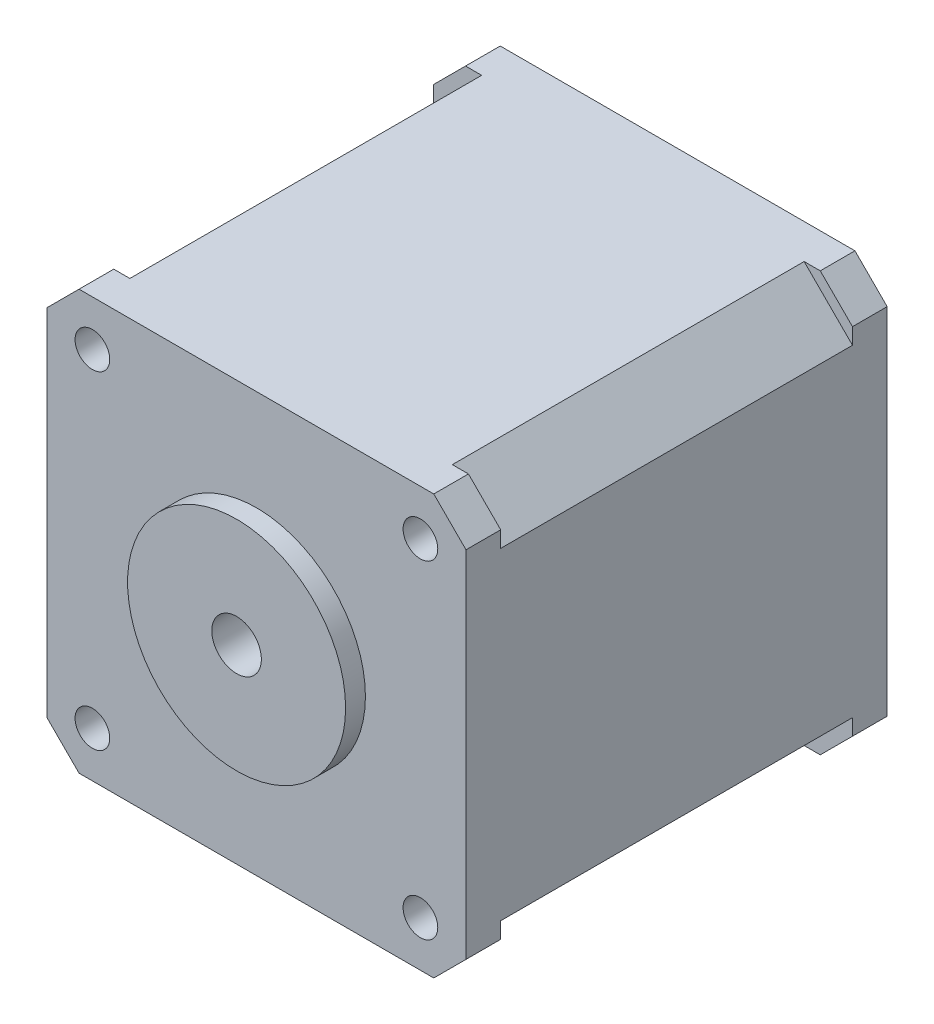
ISO-10303-21;
HEADER;
FILE_DESCRIPTION(('STEP AP214'),'2;1');
FILE_NAME('part.step','',(''),(''),'','','');
FILE_SCHEMA(('AUTOMOTIVE_DESIGN { 1 0 10303 214 1 1 1 1 }'));
ENDSEC;
DATA;
#1=APPLICATION_CONTEXT('core data for automotive mechanical design processes');
#2=APPLICATION_PROTOCOL_DEFINITION('international standard','automotive_design',2000,#1);
#3=PRODUCT_CONTEXT('',#1,'mechanical');
#4=PRODUCT('Part','Part','',(#3));
#5=PRODUCT_RELATED_PRODUCT_CATEGORY('part','',(#4));
#6=PRODUCT_DEFINITION_FORMATION('','',#4);
#7=PRODUCT_DEFINITION_CONTEXT('part definition',#1,'design');
#8=PRODUCT_DEFINITION('design','',#6,#7);
#9=PRODUCT_DEFINITION_SHAPE('','',#8);
#10=(LENGTH_UNIT() NAMED_UNIT(*) SI_UNIT(.MILLI.,.METRE.));
#11=(NAMED_UNIT(*) PLANE_ANGLE_UNIT() SI_UNIT($,.RADIAN.));
#12=(NAMED_UNIT(*) SI_UNIT($,.STERADIAN.) SOLID_ANGLE_UNIT());
#13=UNCERTAINTY_MEASURE_WITH_UNIT(LENGTH_MEASURE(1.E-05),#10,'distance_accuracy_value','');
#14=(GEOMETRIC_REPRESENTATION_CONTEXT(3) GLOBAL_UNCERTAINTY_ASSIGNED_CONTEXT((#13)) GLOBAL_UNIT_ASSIGNED_CONTEXT((#10,
#11,#12)) REPRESENTATION_CONTEXT('',''));
#15=CARTESIAN_POINT('',(0.,0.,0.));
#16=DIRECTION('',(0.,0.,1.));
#17=DIRECTION('',(1.,0.,0.));
#18=AXIS2_PLACEMENT_3D('',#15,#16,#17);
#19=CARTESIAN_POINT('',(-21.15,-21.15,42.5));
#20=DIRECTION('',(1.,0.,0.));
#21=DIRECTION('',(0.,0.,-1.));
#22=AXIS2_PLACEMENT_3D('',#19,#20,#21);
#23=PLANE('',#22);
#24=DIRECTION('',(0.,1.,0.));
#25=VECTOR('',#24,1.);
#26=CARTESIAN_POINT('',(-21.15,-21.15,39.));
#27=LINE('',#26,#25);
#28=CARTESIAN_POINT('',(-21.1500000000011,-17.8973088065396,39.));
#29=VERTEX_POINT('',#28);
#30=CARTESIAN_POINT('',(-21.15,-16.2709632098128,39.));
#31=VERTEX_POINT('',#30);
#32=EDGE_CURVE('E223',#29,#31,#27,.T.);
#33=ORIENTED_EDGE('',*,*,#32,.F.);
#34=DIRECTION('',(0.,0.,1.));
#35=VECTOR('',#34,1.);
#36=CARTESIAN_POINT('',(-21.1500000000011,-17.8973088065396,0.));
#37=LINE('',#36,#35);
#38=CARTESIAN_POINT('',(-21.1500000000011,-17.8973088065396,42.5));
#39=VERTEX_POINT('',#38);
#40=EDGE_CURVE('E312',#29,#39,#37,.T.);
#41=ORIENTED_EDGE('',*,*,#40,.T.);
#42=DIRECTION('',(0.,-1.,0.));
#43=VECTOR('',#42,1.);
#44=CARTESIAN_POINT('',(-21.15,-21.15,42.5));
#45=LINE('',#44,#43);
#46=CARTESIAN_POINT('',(-21.15,17.8973088065419,42.5));
#47=VERTEX_POINT('',#46);
#48=EDGE_CURVE('E360',#47,#39,#45,.T.);
#49=ORIENTED_EDGE('',*,*,#48,.F.);
#50=DIRECTION('',(0.,0.,1.));
#51=VECTOR('',#50,1.);
#52=CARTESIAN_POINT('',(-21.15,17.8973088065419,0.));
#53=LINE('',#52,#51);
#54=CARTESIAN_POINT('',(-21.15,17.8973088065419,39.));
#55=VERTEX_POINT('',#54);
#56=EDGE_CURVE('E318',#55,#47,#53,.T.);
#57=ORIENTED_EDGE('',*,*,#56,.F.);
#58=DIRECTION('',(0.,1.,0.));
#59=VECTOR('',#58,1.);
#60=CARTESIAN_POINT('',(-21.15,-21.15,39.));
#61=LINE('',#60,#59);
#62=CARTESIAN_POINT('',(-21.15,16.2709632098128,39.));
#63=VERTEX_POINT('',#62);
#64=EDGE_CURVE('E253',#63,#55,#61,.T.);
#65=ORIENTED_EDGE('',*,*,#64,.F.);
#66=DIRECTION('',(0.,0.,1.));
#67=VECTOR('',#66,1.);
#68=CARTESIAN_POINT('',(-21.15,16.2709632098128,42.5));
#69=LINE('',#68,#67);
#70=CARTESIAN_POINT('',(-21.15,16.2709632098128,3.5));
#71=VERTEX_POINT('',#70);
#72=EDGE_CURVE('E255',#71,#63,#69,.T.);
#73=ORIENTED_EDGE('',*,*,#72,.F.);
#74=DIRECTION('',(0.,1.,0.));
#75=VECTOR('',#74,1.);
#76=CARTESIAN_POINT('',(-21.15,-21.15,3.5));
#77=LINE('',#76,#75);
#78=CARTESIAN_POINT('',(-21.15,17.8973088065419,3.5));
#79=VERTEX_POINT('',#78);
#80=EDGE_CURVE('E248',#71,#79,#77,.T.);
#81=ORIENTED_EDGE('',*,*,#80,.T.);
#82=CARTESIAN_POINT('',(-21.15,17.8973088065419,0.));
#83=VERTEX_POINT('',#82);
#84=EDGE_CURVE('E326',#83,#79,#53,.T.);
#85=ORIENTED_EDGE('',*,*,#84,.F.);
#86=DIRECTION('',(0.,-1.,0.));
#87=VECTOR('',#86,1.);
#88=CARTESIAN_POINT('',(-21.15,-21.15,0.));
#89=LINE('',#88,#87);
#90=CARTESIAN_POINT('',(-21.15,-17.8973088065407,0.));
#91=VERTEX_POINT('',#90);
#92=EDGE_CURVE('E355',#83,#91,#89,.T.);
#93=ORIENTED_EDGE('',*,*,#92,.T.);
#94=CARTESIAN_POINT('',(-21.1500000000011,-17.8973088065396,3.5));
#95=VERTEX_POINT('',#94);
#96=EDGE_CURVE('E298',#91,#95,#37,.T.);
#97=ORIENTED_EDGE('',*,*,#96,.T.);
#98=DIRECTION('',(0.,1.,0.));
#99=VECTOR('',#98,1.);
#100=CARTESIAN_POINT('',(-21.15,-21.15,3.5));
#101=LINE('',#100,#99);
#102=CARTESIAN_POINT('',(-21.15,-16.2709632098128,3.5));
#103=VERTEX_POINT('',#102);
#104=EDGE_CURVE('E204',#95,#103,#101,.T.);
#105=ORIENTED_EDGE('',*,*,#104,.T.);
#106=DIRECTION('',(0.,0.,-1.));
#107=VECTOR('',#106,1.);
#108=CARTESIAN_POINT('',(-21.15,-16.2709632098128,42.5));
#109=LINE('',#108,#107);
#110=EDGE_CURVE('E212',#31,#103,#109,.T.);
#111=ORIENTED_EDGE('',*,*,#110,.F.);
#112=EDGE_LOOP('',(#33,#41,#49,#57,#65,#73,#81,#85,#93,#97,#105,#111));
#113=FACE_BOUND('',#112,.T.);
#114=ADVANCED_FACE('F32',(#113),#23,.F.);
#115=CARTESIAN_POINT('',(21.15,-21.15,42.5));
#116=DIRECTION('',(0.,1.,0.));
#117=DIRECTION('',(-1.,0.,0.));
#118=AXIS2_PLACEMENT_3D('',#115,#116,#117);
#119=PLANE('',#118);
#120=DIRECTION('',(-1.,0.,0.));
#121=VECTOR('',#120,1.);
#122=CARTESIAN_POINT('',(21.15,-21.15,39.));
#123=LINE('',#122,#121);
#124=CARTESIAN_POINT('',(-16.2709632098128,-21.15,39.));
#125=VERTEX_POINT('',#124);
#126=CARTESIAN_POINT('',(-17.897308806543,-21.1499999999977,39.));
#127=VERTEX_POINT('',#126);
#128=EDGE_CURVE('E218',#125,#127,#123,.T.);
#129=ORIENTED_EDGE('',*,*,#128,.F.);
#130=DIRECTION('',(0.,0.,1.));
#131=VECTOR('',#130,1.);
#132=CARTESIAN_POINT('',(-16.2709632098128,-21.15,42.5));
#133=LINE('',#132,#131);
#134=CARTESIAN_POINT('',(-16.2709632098128,-21.15,3.5));
#135=VERTEX_POINT('',#134);
#136=EDGE_CURVE('E11',#135,#125,#133,.T.);
#137=ORIENTED_EDGE('',*,*,#136,.F.);
#138=DIRECTION('',(-1.,0.,0.));
#139=VECTOR('',#138,1.);
#140=CARTESIAN_POINT('',(21.15,-21.15,3.5));
#141=LINE('',#140,#139);
#142=CARTESIAN_POINT('',(-17.897308806543,-21.1499999999977,3.5));
#143=VERTEX_POINT('',#142);
#144=EDGE_CURVE('E193',#135,#143,#141,.T.);
#145=ORIENTED_EDGE('',*,*,#144,.T.);
#146=DIRECTION('',(0.,0.,1.));
#147=VECTOR('',#146,1.);
#148=CARTESIAN_POINT('',(-17.897308806543,-21.1499999999977,0.));
#149=LINE('',#148,#147);
#150=CARTESIAN_POINT('',(-17.897308806543,-21.1499999999977,0.));
#151=VERTEX_POINT('',#150);
#152=EDGE_CURVE('E313',#151,#143,#149,.T.);
#153=ORIENTED_EDGE('',*,*,#152,.F.);
#154=DIRECTION('',(1.,0.,0.));
#155=VECTOR('',#154,1.);
#156=CARTESIAN_POINT('',(21.15,-21.15,0.));
#157=LINE('',#156,#155);
#158=CARTESIAN_POINT('',(17.8973088065374,-21.15,0.));
#159=VERTEX_POINT('',#158);
#160=EDGE_CURVE('E374',#151,#159,#157,.T.);
#161=ORIENTED_EDGE('',*,*,#160,.T.);
#162=DIRECTION('',(0.,0.,1.));
#163=VECTOR('',#162,1.);
#164=CARTESIAN_POINT('',(17.8973088065385,-21.1499999999988,0.));
#165=LINE('',#164,#163);
#166=CARTESIAN_POINT('',(17.8973088065385,-21.1499999999988,3.5));
#167=VERTEX_POINT('',#166);
#168=EDGE_CURVE('E282',#159,#167,#165,.T.);
#169=ORIENTED_EDGE('',*,*,#168,.T.);
#170=DIRECTION('',(1.,0.,0.));
#171=VECTOR('',#170,1.);
#172=CARTESIAN_POINT('',(21.15,-21.15,3.5));
#173=LINE('',#172,#171);
#174=CARTESIAN_POINT('',(16.2709632098128,-21.15,3.5));
#175=VERTEX_POINT('',#174);
#176=EDGE_CURVE('E230',#175,#167,#173,.T.);
#177=ORIENTED_EDGE('',*,*,#176,.F.);
#178=DIRECTION('',(0.,0.,-1.));
#179=VECTOR('',#178,1.);
#180=CARTESIAN_POINT('',(16.2709632098128,-21.15,42.5));
#181=LINE('',#180,#179);
#182=CARTESIAN_POINT('',(16.2709632098128,-21.15,39.));
#183=VERTEX_POINT('',#182);
#184=EDGE_CURVE('E259',#183,#175,#181,.T.);
#185=ORIENTED_EDGE('',*,*,#184,.F.);
#186=DIRECTION('',(1.,0.,0.));
#187=VECTOR('',#186,1.);
#188=CARTESIAN_POINT('',(21.15,-21.15,39.));
#189=LINE('',#188,#187);
#190=CARTESIAN_POINT('',(17.8973088065385,-21.1499999999988,39.));
#191=VERTEX_POINT('',#190);
#192=EDGE_CURVE('E235',#183,#191,#189,.T.);
#193=ORIENTED_EDGE('',*,*,#192,.T.);
#194=CARTESIAN_POINT('',(17.8973088065385,-21.1499999999988,42.5));
#195=VERTEX_POINT('',#194);
#196=EDGE_CURVE('E301',#191,#195,#165,.T.);
#197=ORIENTED_EDGE('',*,*,#196,.T.);
#198=DIRECTION('',(1.,0.,0.));
#199=VECTOR('',#198,1.);
#200=CARTESIAN_POINT('',(21.15,-21.15,42.5));
#201=LINE('',#200,#199);
#202=CARTESIAN_POINT('',(-17.897308806543,-21.1499999999977,42.5));
#203=VERTEX_POINT('',#202);
#204=EDGE_CURVE('E363',#203,#195,#201,.T.);
#205=ORIENTED_EDGE('',*,*,#204,.F.);
#206=EDGE_CURVE('E220',#127,#203,#149,.T.);
#207=ORIENTED_EDGE('',*,*,#206,.F.);
#208=EDGE_LOOP('',(#129,#137,#145,#153,#161,#169,#177,#185,#193,#197,#205,#207));
#209=FACE_BOUND('',#208,.T.);
#210=ADVANCED_FACE('F216',(#209),#119,.F.);
#211=CARTESIAN_POINT('',(21.15,21.15,42.5));
#212=DIRECTION('',(0.,-1.,0.));
#213=DIRECTION('',(0.,0.,-1.));
#214=AXIS2_PLACEMENT_3D('',#211,#212,#213);
#215=PLANE('',#214);
#216=DIRECTION('',(0.,0.,1.));
#217=VECTOR('',#216,1.);
#218=CARTESIAN_POINT('',(17.8973088065396,21.1499999999989,0.));
#219=LINE('',#218,#217);
#220=CARTESIAN_POINT('',(17.8973088065396,21.1499999999989,39.));
#221=VERTEX_POINT('',#220);
#222=CARTESIAN_POINT('',(17.8973088065396,21.1499999999989,42.5));
#223=VERTEX_POINT('',#222);
#224=EDGE_CURVE('E278',#221,#223,#219,.T.);
#225=ORIENTED_EDGE('',*,*,#224,.F.);
#226=DIRECTION('',(-1.,0.,0.));
#227=VECTOR('',#226,1.);
#228=CARTESIAN_POINT('',(21.15,21.15,39.));
#229=LINE('',#228,#227);
#230=CARTESIAN_POINT('',(16.2709632098128,21.15,39.));
#231=VERTEX_POINT('',#230);
#232=EDGE_CURVE('E241',#221,#231,#229,.T.);
#233=ORIENTED_EDGE('',*,*,#232,.T.);
#234=DIRECTION('',(0.,0.,1.));
#235=VECTOR('',#234,1.);
#236=CARTESIAN_POINT('',(16.2709632098128,21.15,42.5));
#237=LINE('',#236,#235);
#238=CARTESIAN_POINT('',(16.2709632098128,21.15,3.5));
#239=VERTEX_POINT('',#238);
#240=EDGE_CURVE('E401',#239,#231,#237,.T.);
#241=ORIENTED_EDGE('',*,*,#240,.F.);
#242=DIRECTION('',(-1.,0.,0.));
#243=VECTOR('',#242,1.);
#244=CARTESIAN_POINT('',(21.15,21.15,3.5));
#245=LINE('',#244,#243);
#246=CARTESIAN_POINT('',(17.8973088065396,21.1499999999989,3.5));
#247=VERTEX_POINT('',#246);
#248=EDGE_CURVE('E238',#247,#239,#245,.T.);
#249=ORIENTED_EDGE('',*,*,#248,.F.);
#250=CARTESIAN_POINT('',(17.8973088065396,21.1499999999989,0.));
#251=VERTEX_POINT('',#250);
#252=EDGE_CURVE('E288',#251,#247,#219,.T.);
#253=ORIENTED_EDGE('',*,*,#252,.F.);
#254=DIRECTION('',(-1.,0.,0.));
#255=VECTOR('',#254,1.);
#256=CARTESIAN_POINT('',(21.15,21.15,0.));
#257=LINE('',#256,#255);
#258=CARTESIAN_POINT('',(-17.8973088065419,21.15,0.));
#259=VERTEX_POINT('',#258);
#260=EDGE_CURVE('E364',#251,#259,#257,.T.);
#261=ORIENTED_EDGE('',*,*,#260,.T.);
#262=DIRECTION('',(0.,0.,1.));
#263=VECTOR('',#262,1.);
#264=CARTESIAN_POINT('',(-17.8973088065419,21.15,0.));
#265=LINE('',#264,#263);
#266=CARTESIAN_POINT('',(-17.8973088065419,21.15,3.5));
#267=VERTEX_POINT('',#266);
#268=EDGE_CURVE('E321',#259,#267,#265,.T.);
#269=ORIENTED_EDGE('',*,*,#268,.T.);
#270=DIRECTION('',(1.,0.,0.));
#271=VECTOR('',#270,1.);
#272=CARTESIAN_POINT('',(21.15,21.15,3.5));
#273=LINE('',#272,#271);
#274=CARTESIAN_POINT('',(-16.2709632098129,21.15,3.5));
#275=VERTEX_POINT('',#274);
#276=EDGE_CURVE('E46',#267,#275,#273,.T.);
#277=ORIENTED_EDGE('',*,*,#276,.T.);
#278=DIRECTION('',(0.,0.,-1.));
#279=VECTOR('',#278,1.);
#280=CARTESIAN_POINT('',(-16.2709632098129,21.15,42.5));
#281=LINE('',#280,#279);
#282=CARTESIAN_POINT('',(-16.2709632098129,21.15,39.));
#283=VERTEX_POINT('',#282);
#284=EDGE_CURVE('E399',#283,#275,#281,.T.);
#285=ORIENTED_EDGE('',*,*,#284,.F.);
#286=DIRECTION('',(1.,0.,0.));
#287=VECTOR('',#286,1.);
#288=CARTESIAN_POINT('',(21.15,21.15,39.));
#289=LINE('',#288,#287);
#290=CARTESIAN_POINT('',(-17.8973088065419,21.15,39.));
#291=VERTEX_POINT('',#290);
#292=EDGE_CURVE('E251',#291,#283,#289,.T.);
#293=ORIENTED_EDGE('',*,*,#292,.F.);
#294=CARTESIAN_POINT('',(-17.8973088065419,21.15,42.5));
#295=VERTEX_POINT('',#294);
#296=EDGE_CURVE('E325',#291,#295,#265,.T.);
#297=ORIENTED_EDGE('',*,*,#296,.T.);
#298=DIRECTION('',(-1.,0.,0.));
#299=VECTOR('',#298,1.);
#300=CARTESIAN_POINT('',(21.15,21.15,42.5));
#301=LINE('',#300,#299);
#302=EDGE_CURVE('E359',#223,#295,#301,.T.);
#303=ORIENTED_EDGE('',*,*,#302,.F.);
#304=EDGE_LOOP('',(#225,#233,#241,#249,#253,#261,#269,#277,#285,#293,#297,#303));
#305=FACE_BOUND('',#304,.T.);
#306=ADVANCED_FACE('F452',(#305),#215,.F.);
#307=CARTESIAN_POINT('',(-17.8973088065419,21.15,0.));
#308=DIRECTION('',(0.707106781186547,-0.707106781186548,0.));
#309=DIRECTION('',(0.707106781186548,0.707106781186547,0.));
#310=AXIS2_PLACEMENT_3D('',#307,#308,#309);
#311=PLANE('',#310);
#312=DIRECTION('',(0.707106781186548,0.707106781186547,0.));
#313=VECTOR('',#312,1.);
#314=CARTESIAN_POINT('',(-17.8973088065419,21.15,39.));
#315=LINE('',#314,#313);
#316=EDGE_CURVE('E397',#55,#291,#315,.T.);
#317=ORIENTED_EDGE('',*,*,#316,.F.);
#318=ORIENTED_EDGE('',*,*,#56,.T.);
#319=DIRECTION('',(0.707106781186548,0.707106781186547,0.));
#320=VECTOR('',#319,1.);
#321=CARTESIAN_POINT('',(-17.8973088065419,21.15,42.5));
#322=LINE('',#321,#320);
#323=EDGE_CURVE('E286',#47,#295,#322,.T.);
#324=ORIENTED_EDGE('',*,*,#323,.T.);
#325=ORIENTED_EDGE('',*,*,#296,.F.);
#326=EDGE_LOOP('',(#317,#318,#324,#325));
#327=FACE_BOUND('',#326,.T.);
#328=ADVANCED_FACE('F475',(#327),#311,.F.);
#329=CARTESIAN_POINT('',(21.1499999999977,17.8973088065408,0.));
#330=DIRECTION('',(-0.707106781186547,-0.707106781186547,0.));
#331=DIRECTION('',(0.707106781186548,-0.707106781186548,0.));
#332=AXIS2_PLACEMENT_3D('',#329,#330,#331);
#333=PLANE('',#332);
#334=DIRECTION('',(-0.707106781186548,0.707106781186548,0.));
#335=VECTOR('',#334,1.);
#336=CARTESIAN_POINT('',(21.1499999999977,17.8973088065408,3.5));
#337=LINE('',#336,#335);
#338=CARTESIAN_POINT('',(21.1499999999977,17.8973088065408,3.5));
#339=VERTEX_POINT('',#338);
#340=EDGE_CURVE('E390',#339,#247,#337,.T.);
#341=ORIENTED_EDGE('',*,*,#340,.F.);
#342=DIRECTION('',(0.,0.,1.));
#343=VECTOR('',#342,1.);
#344=CARTESIAN_POINT('',(21.1499999999977,17.8973088065408,0.));
#345=LINE('',#344,#343);
#346=CARTESIAN_POINT('',(21.15,17.8973088065385,0.));
#347=VERTEX_POINT('',#346);
#348=EDGE_CURVE('E283',#347,#339,#345,.T.);
#349=ORIENTED_EDGE('',*,*,#348,.F.);
#350=DIRECTION('',(0.707106781186548,-0.707106781186548,0.));
#351=VECTOR('',#350,1.);
#352=CARTESIAN_POINT('',(21.1499999999977,17.8973088065408,0.));
#353=LINE('',#352,#351);
#354=EDGE_CURVE('E275',#251,#347,#353,.T.);
#355=ORIENTED_EDGE('',*,*,#354,.F.);
#356=ORIENTED_EDGE('',*,*,#252,.T.);
#357=EDGE_LOOP('',(#341,#349,#355,#356));
#358=FACE_BOUND('',#357,.T.);
#359=ADVANCED_FACE('F491',(#358),#333,.F.);
#360=CARTESIAN_POINT('',(17.8973088065385,-21.1499999999988,0.));
#361=DIRECTION('',(-0.707106781186547,0.707106781186547,0.));
#362=DIRECTION('',(-0.707106781186548,-0.707106781186548,0.));
#363=AXIS2_PLACEMENT_3D('',#360,#361,#362);
#364=PLANE('',#363);
#365=DIRECTION('',(0.707106781186548,0.707106781186548,0.));
#366=VECTOR('',#365,1.);
#367=CARTESIAN_POINT('',(17.8973088065385,-21.1499999999988,3.5));
#368=LINE('',#367,#366);
#369=CARTESIAN_POINT('',(21.1499999999967,-17.8973088065407,3.5));
#370=VERTEX_POINT('',#369);
#371=EDGE_CURVE('E385',#167,#370,#368,.T.);
#372=ORIENTED_EDGE('',*,*,#371,.F.);
#373=ORIENTED_EDGE('',*,*,#168,.F.);
#374=DIRECTION('',(-0.707106781186548,-0.707106781186548,0.));
#375=VECTOR('',#374,1.);
#376=CARTESIAN_POINT('',(17.8973088065385,-21.1499999999988,0.));
#377=LINE('',#376,#375);
#378=CARTESIAN_POINT('',(21.1499999999967,-17.8973088065407,0.));
#379=VERTEX_POINT('',#378);
#380=EDGE_CURVE('E291',#379,#159,#377,.T.);
#381=ORIENTED_EDGE('',*,*,#380,.F.);
#382=DIRECTION('',(0.,0.,1.));
#383=VECTOR('',#382,1.);
#384=CARTESIAN_POINT('',(21.1499999999967,-17.8973088065407,0.));
#385=LINE('',#384,#383);
#386=EDGE_CURVE('E302',#379,#370,#385,.T.);
#387=ORIENTED_EDGE('',*,*,#386,.T.);
#388=EDGE_LOOP('',(#372,#373,#381,#387));
#389=FACE_BOUND('',#388,.T.);
#390=ADVANCED_FACE('F495',(#389),#364,.F.);
#391=CARTESIAN_POINT('',(-21.1500000000011,-17.8973088065396,0.));
#392=DIRECTION('',(0.707106781186547,0.707106781186547,0.));
#393=DIRECTION('',(-0.707106781186548,0.707106781186548,0.));
#394=AXIS2_PLACEMENT_3D('',#391,#392,#393);
#395=PLANE('',#394);
#396=DIRECTION('',(-0.707106781186548,0.707106781186548,0.));
#397=VECTOR('',#396,1.);
#398=CARTESIAN_POINT('',(-21.1500000000011,-17.8973088065396,39.));
#399=LINE('',#398,#397);
#400=EDGE_CURVE('E383',#127,#29,#399,.T.);
#401=ORIENTED_EDGE('',*,*,#400,.F.);
#402=ORIENTED_EDGE('',*,*,#206,.T.);
#403=DIRECTION('',(-0.707106781186548,0.707106781186548,0.));
#404=VECTOR('',#403,1.);
#405=CARTESIAN_POINT('',(-21.1500000000011,-17.8973088065396,42.5));
#406=LINE('',#405,#404);
#407=EDGE_CURVE('E272',#203,#39,#406,.T.);
#408=ORIENTED_EDGE('',*,*,#407,.T.);
#409=ORIENTED_EDGE('',*,*,#40,.F.);
#410=EDGE_LOOP('',(#401,#402,#408,#409));
#411=FACE_BOUND('',#410,.T.);
#412=ADVANCED_FACE('F501',(#411),#395,.F.);
#413=CARTESIAN_POINT('',(21.15,-21.15,42.5));
#414=DIRECTION('',(-1.,0.,0.));
#415=DIRECTION('',(0.,0.,1.));
#416=AXIS2_PLACEMENT_3D('',#413,#414,#415);
#417=PLANE('',#416);
#418=DIRECTION('',(0.,0.,-1.));
#419=VECTOR('',#418,1.);
#420=CARTESIAN_POINT('',(21.15,16.2709632098128,42.5));
#421=LINE('',#420,#419);
#422=CARTESIAN_POINT('',(21.15,16.2709632098128,39.));
#423=VERTEX_POINT('',#422);
#424=CARTESIAN_POINT('',(21.15,16.2709632098128,3.5));
#425=VERTEX_POINT('',#424);
#426=EDGE_CURVE('E257',#423,#425,#421,.T.);
#427=ORIENTED_EDGE('',*,*,#426,.F.);
#428=DIRECTION('',(0.,1.,0.));
#429=VECTOR('',#428,1.);
#430=CARTESIAN_POINT('',(21.15,-21.15,39.));
#431=LINE('',#430,#429);
#432=CARTESIAN_POINT('',(21.1499999999977,17.8973088065408,39.));
#433=VERTEX_POINT('',#432);
#434=EDGE_CURVE('E244',#423,#433,#431,.T.);
#435=ORIENTED_EDGE('',*,*,#434,.T.);
#436=CARTESIAN_POINT('',(21.1499999999977,17.8973088065408,42.5));
#437=VERTEX_POINT('',#436);
#438=EDGE_CURVE('E287',#433,#437,#345,.T.);
#439=ORIENTED_EDGE('',*,*,#438,.T.);
#440=DIRECTION('',(0.,1.,0.));
#441=VECTOR('',#440,1.);
#442=CARTESIAN_POINT('',(21.15,-21.15,42.5));
#443=LINE('',#442,#441);
#444=CARTESIAN_POINT('',(21.1499999999967,-17.8973088065407,42.5));
#445=VERTEX_POINT('',#444);
#446=EDGE_CURVE('E367',#445,#437,#443,.T.);
#447=ORIENTED_EDGE('',*,*,#446,.F.);
#448=CARTESIAN_POINT('',(21.1499999999967,-17.8973088065407,39.));
#449=VERTEX_POINT('',#448);
#450=EDGE_CURVE('E294',#449,#445,#385,.T.);
#451=ORIENTED_EDGE('',*,*,#450,.F.);
#452=DIRECTION('',(0.,1.,0.));
#453=VECTOR('',#452,1.);
#454=CARTESIAN_POINT('',(21.15,-21.15,39.));
#455=LINE('',#454,#453);
#456=CARTESIAN_POINT('',(21.15,-16.2709632098128,39.));
#457=VERTEX_POINT('',#456);
#458=EDGE_CURVE('E232',#449,#457,#455,.T.);
#459=ORIENTED_EDGE('',*,*,#458,.T.);
#460=DIRECTION('',(0.,0.,1.));
#461=VECTOR('',#460,1.);
#462=CARTESIAN_POINT('',(21.15,-16.2709632098128,42.5));
#463=LINE('',#462,#461);
#464=CARTESIAN_POINT('',(21.15,-16.2709632098128,3.5));
#465=VERTEX_POINT('',#464);
#466=EDGE_CURVE('E39',#465,#457,#463,.T.);
#467=ORIENTED_EDGE('',*,*,#466,.F.);
#468=DIRECTION('',(0.,1.,0.));
#469=VECTOR('',#468,1.);
#470=CARTESIAN_POINT('',(21.15,-21.15,3.5));
#471=LINE('',#470,#469);
#472=EDGE_CURVE('E225',#370,#465,#471,.T.);
#473=ORIENTED_EDGE('',*,*,#472,.F.);
#474=ORIENTED_EDGE('',*,*,#386,.F.);
#475=DIRECTION('',(0.,1.,0.));
#476=VECTOR('',#475,1.);
#477=CARTESIAN_POINT('',(21.15,-21.15,0.));
#478=LINE('',#477,#476);
#479=EDGE_CURVE('E377',#379,#347,#478,.T.);
#480=ORIENTED_EDGE('',*,*,#479,.T.);
#481=ORIENTED_EDGE('',*,*,#348,.T.);
#482=DIRECTION('',(0.,1.,0.));
#483=VECTOR('',#482,1.);
#484=CARTESIAN_POINT('',(21.15,-21.15,3.5));
#485=LINE('',#484,#483);
#486=EDGE_CURVE('E54',#425,#339,#485,.T.);
#487=ORIENTED_EDGE('',*,*,#486,.F.);
#488=EDGE_LOOP('',(#427,#435,#439,#447,#451,#459,#467,#473,#474,#480,#481,#487));
#489=FACE_BOUND('',#488,.T.);
#490=ADVANCED_FACE('F420',(#489),#417,.F.);
#491=CARTESIAN_POINT('',(0.,0.,42.5));
#492=DIRECTION('',(0.,0.,1.));
#493=DIRECTION('',(1.,0.,0.));
#494=AXIS2_PLACEMENT_3D('',#491,#492,#493);
#495=PLANE('',#494);
#496=ORIENTED_EDGE('',*,*,#407,.F.);
#497=ORIENTED_EDGE('',*,*,#204,.T.);
#498=DIRECTION('',(-0.707106781186548,-0.707106781186548,0.));
#499=VECTOR('',#498,1.);
#500=CARTESIAN_POINT('',(17.8973088065385,-21.1499999999988,42.5));
#501=LINE('',#500,#499);
#502=EDGE_CURVE('E295',#445,#195,#501,.T.);
#503=ORIENTED_EDGE('',*,*,#502,.F.);
#504=ORIENTED_EDGE('',*,*,#446,.T.);
#505=DIRECTION('',(0.707106781186548,-0.707106781186548,0.));
#506=VECTOR('',#505,1.);
#507=CARTESIAN_POINT('',(21.1499999999977,17.8973088065408,42.5));
#508=LINE('',#507,#506);
#509=EDGE_CURVE('E279',#223,#437,#508,.T.);
#510=ORIENTED_EDGE('',*,*,#509,.F.);
#511=ORIENTED_EDGE('',*,*,#302,.T.);
#512=ORIENTED_EDGE('',*,*,#323,.F.);
#513=ORIENTED_EDGE('',*,*,#48,.T.);
#514=EDGE_LOOP('',(#496,#497,#503,#504,#510,#511,#512,#513));
#515=FACE_BOUND('',#514,.T.);
#516=CARTESIAN_POINT('',(-16.5499999999991,-16.55,42.5));
#517=DIRECTION('',(0.,0.,1.));
#518=DIRECTION('',(1.,0.,0.));
#519=AXIS2_PLACEMENT_3D('',#516,#517,#518);
#520=CIRCLE('',#519,1.7500000000005);
#521=CARTESIAN_POINT('',(-14.7999999999986,-16.55,42.5));
#522=VERTEX_POINT('',#521);
#523=EDGE_CURVE('E324',#522,#522,#520,.T.);
#524=ORIENTED_EDGE('',*,*,#523,.F.);
#525=EDGE_LOOP('',(#524));
#526=FACE_BOUND('',#525,.T.);
#527=CARTESIAN_POINT('',(16.5500000000009,-16.5499999999991,42.5));
#528=DIRECTION('',(0.,0.,1.));
#529=DIRECTION('',(1.,0.,0.));
#530=AXIS2_PLACEMENT_3D('',#527,#528,#529);
#531=CIRCLE('',#530,1.7500000000013);
#532=CARTESIAN_POINT('',(18.3000000000022,-16.5499999999991,42.5));
#533=VERTEX_POINT('',#532);
#534=EDGE_CURVE('E339',#533,#533,#531,.T.);
#535=ORIENTED_EDGE('',*,*,#534,.F.);
#536=EDGE_LOOP('',(#535));
#537=FACE_BOUND('',#536,.T.);
#538=CARTESIAN_POINT('',(16.55,16.5500000000009,42.5));
#539=DIRECTION('',(0.,0.,1.));
#540=DIRECTION('',(1.,0.,0.));
#541=AXIS2_PLACEMENT_3D('',#538,#539,#540);
#542=CIRCLE('',#541,1.75000000000095);
#543=CARTESIAN_POINT('',(18.300000000001,16.5500000000009,42.5));
#544=VERTEX_POINT('',#543);
#545=EDGE_CURVE('E333',#544,#544,#542,.T.);
#546=ORIENTED_EDGE('',*,*,#545,.F.);
#547=EDGE_LOOP('',(#546));
#548=FACE_BOUND('',#547,.T.);
#549=CARTESIAN_POINT('',(-16.55,16.55,42.5));
#550=DIRECTION('',(0.,0.,1.));
#551=DIRECTION('',(1.,0.,0.));
#552=AXIS2_PLACEMENT_3D('',#549,#550,#551);
#553=CIRCLE('',#552,1.75);
#554=CARTESIAN_POINT('',(-14.8,16.55,42.5));
#555=VERTEX_POINT('',#554);
#556=EDGE_CURVE('E332',#555,#555,#553,.T.);
#557=ORIENTED_EDGE('',*,*,#556,.F.);
#558=EDGE_LOOP('',(#557));
#559=FACE_BOUND('',#558,.T.);
#560=CARTESIAN_POINT('',(0.,0.,42.5));
#561=DIRECTION('',(0.,0.,1.));
#562=DIRECTION('',(1.,0.,0.));
#563=AXIS2_PLACEMENT_3D('',#560,#561,#562);
#564=CIRCLE('',#563,11.);
#565=CARTESIAN_POINT('',(11.,0.,42.5));
#566=VERTEX_POINT('',#565);
#567=EDGE_CURVE('E356',#566,#566,#564,.T.);
#568=ORIENTED_EDGE('',*,*,#567,.F.);
#569=EDGE_LOOP('',(#568));
#570=FACE_BOUND('',#569,.T.);
#571=ADVANCED_FACE('F428',(#515,#526,#537,#548,#559,#570),#495,.T.);
#572=CARTESIAN_POINT('',(0.,0.,0.));
#573=DIRECTION('',(0.,0.,1.));
#574=DIRECTION('',(1.,0.,0.));
#575=AXIS2_PLACEMENT_3D('',#572,#573,#574);
#576=PLANE('',#575);
#577=CARTESIAN_POINT('',(0.,0.,0.));
#578=DIRECTION('',(0.,0.,-1.));
#579=DIRECTION('',(-1.,0.,0.));
#580=AXIS2_PLACEMENT_3D('',#577,#578,#579);
#581=CIRCLE('',#580,5.);
#582=CARTESIAN_POINT('',(-5.,0.,0.));
#583=VERTEX_POINT('',#582);
#584=EDGE_CURVE('E268',#583,#583,#581,.T.);
#585=ORIENTED_EDGE('',*,*,#584,.F.);
#586=EDGE_LOOP('',(#585));
#587=FACE_BOUND('',#586,.T.);
#588=CARTESIAN_POINT('',(-16.5499999999991,-16.55,0.));
#589=DIRECTION('',(0.,0.,1.));
#590=DIRECTION('',(1.,0.,0.));
#591=AXIS2_PLACEMENT_3D('',#588,#589,#590);
#592=CIRCLE('',#591,1.7500000000005);
#593=CARTESIAN_POINT('',(-14.7999999999986,-16.55,0.));
#594=VERTEX_POINT('',#593);
#595=EDGE_CURVE('E342',#594,#594,#592,.T.);
#596=ORIENTED_EDGE('',*,*,#595,.T.);
#597=EDGE_LOOP('',(#596));
#598=FACE_BOUND('',#597,.T.);
#599=CARTESIAN_POINT('',(16.5500000000009,-16.5499999999991,0.));
#600=DIRECTION('',(0.,0.,1.));
#601=DIRECTION('',(1.,0.,0.));
#602=AXIS2_PLACEMENT_3D('',#599,#600,#601);
#603=CIRCLE('',#602,1.7500000000013);
#604=CARTESIAN_POINT('',(18.3000000000022,-16.5499999999991,0.));
#605=VERTEX_POINT('',#604);
#606=EDGE_CURVE('E336',#605,#605,#603,.T.);
#607=ORIENTED_EDGE('',*,*,#606,.T.);
#608=EDGE_LOOP('',(#607));
#609=FACE_BOUND('',#608,.T.);
#610=CARTESIAN_POINT('',(16.55,16.5500000000009,0.));
#611=DIRECTION('',(0.,0.,1.));
#612=DIRECTION('',(1.,0.,0.));
#613=AXIS2_PLACEMENT_3D('',#610,#611,#612);
#614=CIRCLE('',#613,1.75000000000095);
#615=CARTESIAN_POINT('',(18.300000000001,16.5500000000009,0.));
#616=VERTEX_POINT('',#615);
#617=EDGE_CURVE('E329',#616,#616,#614,.T.);
#618=ORIENTED_EDGE('',*,*,#617,.T.);
#619=EDGE_LOOP('',(#618));
#620=FACE_BOUND('',#619,.T.);
#621=CARTESIAN_POINT('',(-16.55,16.55,0.));
#622=DIRECTION('',(0.,0.,1.));
#623=DIRECTION('',(1.,0.,0.));
#624=AXIS2_PLACEMENT_3D('',#621,#622,#623);
#625=CIRCLE('',#624,1.75);
#626=CARTESIAN_POINT('',(-14.8,16.55,0.));
#627=VERTEX_POINT('',#626);
#628=EDGE_CURVE('E347',#627,#627,#625,.T.);
#629=ORIENTED_EDGE('',*,*,#628,.T.);
#630=EDGE_LOOP('',(#629));
#631=FACE_BOUND('',#630,.T.);
#632=ORIENTED_EDGE('',*,*,#160,.F.);
#633=DIRECTION('',(-0.707106781186548,0.707106781186548,0.));
#634=VECTOR('',#633,1.);
#635=CARTESIAN_POINT('',(-21.1500000000011,-17.8973088065396,0.));
#636=LINE('',#635,#634);
#637=EDGE_CURVE('E305',#151,#91,#636,.T.);
#638=ORIENTED_EDGE('',*,*,#637,.T.);
#639=ORIENTED_EDGE('',*,*,#92,.F.);
#640=DIRECTION('',(0.707106781186548,0.707106781186547,0.));
#641=VECTOR('',#640,1.);
#642=CARTESIAN_POINT('',(-17.8973088065419,21.15,0.));
#643=LINE('',#642,#641);
#644=EDGE_CURVE('E315',#83,#259,#643,.T.);
#645=ORIENTED_EDGE('',*,*,#644,.T.);
#646=ORIENTED_EDGE('',*,*,#260,.F.);
#647=ORIENTED_EDGE('',*,*,#354,.T.);
#648=ORIENTED_EDGE('',*,*,#479,.F.);
#649=ORIENTED_EDGE('',*,*,#380,.T.);
#650=EDGE_LOOP('',(#632,#638,#639,#645,#646,#647,#648,#649));
#651=FACE_BOUND('',#650,.T.);
#652=ADVANCED_FACE('F462',(#587,#598,#609,#620,#631,#651),#576,.F.);
#653=CARTESIAN_POINT('',(0.,0.,44.5));
#654=DIRECTION('',(0.,0.,-1.));
#655=DIRECTION('',(-1.,0.,0.));
#656=AXIS2_PLACEMENT_3D('',#653,#654,#655);
#657=CYLINDRICAL_SURFACE('',#656,11.);
#658=CARTESIAN_POINT('',(0.,0.,44.5));
#659=DIRECTION('',(0.,0.,1.));
#660=DIRECTION('',(1.,0.,0.));
#661=AXIS2_PLACEMENT_3D('',#658,#659,#660);
#662=CIRCLE('',#661,11.);
#663=CARTESIAN_POINT('',(11.,0.,44.5));
#664=VERTEX_POINT('',#663);
#665=EDGE_CURVE('E350',#664,#664,#662,.T.);
#666=ORIENTED_EDGE('',*,*,#665,.F.);
#667=EDGE_LOOP('',(#666));
#668=FACE_BOUND('',#667,.T.);
#669=ORIENTED_EDGE('',*,*,#567,.T.);
#670=EDGE_LOOP('',(#669));
#671=FACE_BOUND('',#670,.T.);
#672=ADVANCED_FACE('F526',(#668,#671),#657,.T.);
#673=CARTESIAN_POINT('',(0.,0.,44.5));
#674=DIRECTION('',(0.,0.,1.));
#675=DIRECTION('',(1.,0.,0.));
#676=AXIS2_PLACEMENT_3D('',#673,#674,#675);
#677=PLANE('',#676);
#678=CARTESIAN_POINT('',(0.,0.,44.5));
#679=DIRECTION('',(0.,0.,1.));
#680=DIRECTION('',(1.,0.,0.));
#681=AXIS2_PLACEMENT_3D('',#678,#679,#680);
#682=CIRCLE('',#681,2.5);
#683=CARTESIAN_POINT('',(2.5,0.,44.5));
#684=VERTEX_POINT('',#683);
#685=EDGE_CURVE('E265',#684,#684,#682,.T.);
#686=ORIENTED_EDGE('',*,*,#685,.F.);
#687=EDGE_LOOP('',(#686));
#688=FACE_BOUND('',#687,.T.);
#689=ORIENTED_EDGE('',*,*,#665,.T.);
#690=EDGE_LOOP('',(#689));
#691=FACE_BOUND('',#690,.T.);
#692=ADVANCED_FACE('F532',(#688,#691),#677,.T.);
#693=CARTESIAN_POINT('',(-16.55,16.55,0.));
#694=DIRECTION('',(0.,0.,1.));
#695=DIRECTION('',(1.,0.,0.));
#696=AXIS2_PLACEMENT_3D('',#693,#694,#695);
#697=CYLINDRICAL_SURFACE('',#696,1.75);
#698=ORIENTED_EDGE('',*,*,#628,.F.);
#699=EDGE_LOOP('',(#698));
#700=FACE_BOUND('',#699,.T.);
#701=ORIENTED_EDGE('',*,*,#556,.T.);
#702=EDGE_LOOP('',(#701));
#703=FACE_BOUND('',#702,.T.);
#704=ADVANCED_FACE('F536',(#700,#703),#697,.F.);
#705=CARTESIAN_POINT('',(16.55,16.5500000000009,0.));
#706=DIRECTION('',(0.,0.,1.));
#707=DIRECTION('',(1.,0.,0.));
#708=AXIS2_PLACEMENT_3D('',#705,#706,#707);
#709=CYLINDRICAL_SURFACE('',#708,1.75000000000095);
#710=ORIENTED_EDGE('',*,*,#617,.F.);
#711=EDGE_LOOP('',(#710));
#712=FACE_BOUND('',#711,.T.);
#713=ORIENTED_EDGE('',*,*,#545,.T.);
#714=EDGE_LOOP('',(#713));
#715=FACE_BOUND('',#714,.T.);
#716=ADVANCED_FACE('F540',(#712,#715),#709,.F.);
#717=CARTESIAN_POINT('',(16.5500000000009,-16.5499999999991,0.));
#718=DIRECTION('',(0.,0.,1.));
#719=DIRECTION('',(1.,0.,0.));
#720=AXIS2_PLACEMENT_3D('',#717,#718,#719);
#721=CYLINDRICAL_SURFACE('',#720,1.7500000000013);
#722=ORIENTED_EDGE('',*,*,#606,.F.);
#723=EDGE_LOOP('',(#722));
#724=FACE_BOUND('',#723,.T.);
#725=ORIENTED_EDGE('',*,*,#534,.T.);
#726=EDGE_LOOP('',(#725));
#727=FACE_BOUND('',#726,.T.);
#728=ADVANCED_FACE('F545',(#724,#727),#721,.F.);
#729=CARTESIAN_POINT('',(-16.5499999999991,-16.55,0.));
#730=DIRECTION('',(0.,0.,1.));
#731=DIRECTION('',(1.,0.,0.));
#732=AXIS2_PLACEMENT_3D('',#729,#730,#731);
#733=CYLINDRICAL_SURFACE('',#732,1.7500000000005);
#734=ORIENTED_EDGE('',*,*,#595,.F.);
#735=EDGE_LOOP('',(#734));
#736=FACE_BOUND('',#735,.T.);
#737=ORIENTED_EDGE('',*,*,#523,.T.);
#738=EDGE_LOOP('',(#737));
#739=FACE_BOUND('',#738,.T.);
#740=ADVANCED_FACE('F542',(#736,#739),#733,.F.);
#741=ORIENTED_EDGE('',*,*,#84,.T.);
#742=DIRECTION('',(0.707106781186548,0.707106781186547,0.));
#743=VECTOR('',#742,1.);
#744=CARTESIAN_POINT('',(-17.8973088065419,21.15,3.5));
#745=LINE('',#744,#743);
#746=EDGE_CURVE('E395',#79,#267,#745,.T.);
#747=ORIENTED_EDGE('',*,*,#746,.T.);
#748=ORIENTED_EDGE('',*,*,#268,.F.);
#749=ORIENTED_EDGE('',*,*,#644,.F.);
#750=EDGE_LOOP('',(#741,#747,#748,#749));
#751=FACE_BOUND('',#750,.T.);
#752=ADVANCED_FACE('F457',(#751),#311,.F.);
#753=ORIENTED_EDGE('',*,*,#438,.F.);
#754=DIRECTION('',(-0.707106781186548,0.707106781186548,0.));
#755=VECTOR('',#754,1.);
#756=CARTESIAN_POINT('',(21.1499999999977,17.8973088065408,39.));
#757=LINE('',#756,#755);
#758=EDGE_CURVE('E392',#433,#221,#757,.T.);
#759=ORIENTED_EDGE('',*,*,#758,.T.);
#760=ORIENTED_EDGE('',*,*,#224,.T.);
#761=ORIENTED_EDGE('',*,*,#509,.T.);
#762=EDGE_LOOP('',(#753,#759,#760,#761));
#763=FACE_BOUND('',#762,.T.);
#764=ADVANCED_FACE('F481',(#763),#333,.F.);
#765=ORIENTED_EDGE('',*,*,#196,.F.);
#766=DIRECTION('',(0.707106781186548,0.707106781186548,0.));
#767=VECTOR('',#766,1.);
#768=CARTESIAN_POINT('',(17.8973088065385,-21.1499999999988,39.));
#769=LINE('',#768,#767);
#770=EDGE_CURVE('E387',#191,#449,#769,.T.);
#771=ORIENTED_EDGE('',*,*,#770,.T.);
#772=ORIENTED_EDGE('',*,*,#450,.T.);
#773=ORIENTED_EDGE('',*,*,#502,.T.);
#774=EDGE_LOOP('',(#765,#771,#772,#773));
#775=FACE_BOUND('',#774,.T.);
#776=ADVANCED_FACE('F425',(#775),#364,.F.);
#777=ORIENTED_EDGE('',*,*,#152,.T.);
#778=DIRECTION('',(-0.707106781186548,0.707106781186548,0.));
#779=VECTOR('',#778,1.);
#780=CARTESIAN_POINT('',(-21.1500000000011,-17.8973088065396,3.5));
#781=LINE('',#780,#779);
#782=EDGE_CURVE('E199',#143,#95,#781,.T.);
#783=ORIENTED_EDGE('',*,*,#782,.T.);
#784=ORIENTED_EDGE('',*,*,#96,.F.);
#785=ORIENTED_EDGE('',*,*,#637,.F.);
#786=EDGE_LOOP('',(#777,#783,#784,#785));
#787=FACE_BOUND('',#786,.T.);
#788=ADVANCED_FACE('F497',(#787),#395,.F.);
#789=CARTESIAN_POINT('',(0.,0.,5.));
#790=DIRECTION('',(0.,0.,-1.));
#791=DIRECTION('',(-1.,0.,0.));
#792=AXIS2_PLACEMENT_3D('',#789,#790,#791);
#793=CYLINDRICAL_SURFACE('',#792,5.);
#794=CARTESIAN_POINT('',(0.,0.,5.));
#795=DIRECTION('',(0.,0.,-1.));
#796=DIRECTION('',(-1.,0.,0.));
#797=AXIS2_PLACEMENT_3D('',#794,#795,#796);
#798=CIRCLE('',#797,5.);
#799=CARTESIAN_POINT('',(-5.,0.,5.));
#800=VERTEX_POINT('',#799);
#801=EDGE_CURVE('E269',#800,#800,#798,.T.);
#802=ORIENTED_EDGE('',*,*,#801,.F.);
#803=EDGE_LOOP('',(#802));
#804=FACE_BOUND('',#803,.T.);
#805=ORIENTED_EDGE('',*,*,#584,.T.);
#806=EDGE_LOOP('',(#805));
#807=FACE_BOUND('',#806,.T.);
#808=ADVANCED_FACE('F499',(#804,#807),#793,.F.);
#809=CARTESIAN_POINT('',(0.,0.,5.));
#810=DIRECTION('',(0.,0.,-1.));
#811=DIRECTION('',(-1.,0.,0.));
#812=AXIS2_PLACEMENT_3D('',#809,#810,#811);
#813=PLANE('',#812);
#814=CARTESIAN_POINT('',(0.,0.,5.));
#815=DIRECTION('',(0.,0.,-1.));
#816=DIRECTION('',(-1.,0.,0.));
#817=AXIS2_PLACEMENT_3D('',#814,#815,#816);
#818=CIRCLE('',#817,2.5);
#819=CARTESIAN_POINT('',(-2.5,0.,5.));
#820=VERTEX_POINT('',#819);
#821=EDGE_CURVE('E262',#820,#820,#818,.T.);
#822=ORIENTED_EDGE('',*,*,#821,.F.);
#823=EDGE_LOOP('',(#822));
#824=FACE_BOUND('',#823,.T.);
#825=ORIENTED_EDGE('',*,*,#801,.T.);
#826=EDGE_LOOP('',(#825));
#827=FACE_BOUND('',#826,.T.);
#828=ADVANCED_FACE('F506',(#824,#827),#813,.T.);
#829=CARTESIAN_POINT('',(0.,0.,-3.));
#830=DIRECTION('',(0.,0.,1.));
#831=DIRECTION('',(1.,0.,0.));
#832=AXIS2_PLACEMENT_3D('',#829,#830,#831);
#833=CYLINDRICAL_SURFACE('',#832,2.5);
#834=ORIENTED_EDGE('',*,*,#685,.T.);
#835=EDGE_LOOP('',(#834));
#836=FACE_BOUND('',#835,.T.);
#837=ORIENTED_EDGE('',*,*,#821,.T.);
#838=EDGE_LOOP('',(#837));
#839=FACE_BOUND('',#838,.T.);
#840=ADVANCED_FACE('F567',(#836,#839),#833,.F.);
#841=CARTESIAN_POINT('',(-12.4209632098128,-25.,39.));
#842=DIRECTION('',(-0.707106781186548,-0.707106781186547,0.));
#843=DIRECTION('',(0.707106781186547,-0.707106781186548,0.));
#844=AXIS2_PLACEMENT_3D('',#841,#842,#843);
#845=PLANE('',#844);
#846=ORIENTED_EDGE('',*,*,#110,.T.);
#847=DIRECTION('',(-0.707106781186547,0.707106781186548,0.));
#848=VECTOR('',#847,1.);
#849=CARTESIAN_POINT('',(-12.4209632098128,-25.,3.5));
#850=LINE('',#849,#848);
#851=EDGE_CURVE('E196',#135,#103,#850,.T.);
#852=ORIENTED_EDGE('',*,*,#851,.F.);
#853=ORIENTED_EDGE('',*,*,#136,.T.);
#854=DIRECTION('',(-0.707106781186547,0.707106781186548,0.));
#855=VECTOR('',#854,1.);
#856=CARTESIAN_POINT('',(-12.4209632098128,-25.,39.));
#857=LINE('',#856,#855);
#858=EDGE_CURVE('E213',#125,#31,#857,.T.);
#859=ORIENTED_EDGE('',*,*,#858,.T.);
#860=EDGE_LOOP('',(#846,#852,#853,#859));
#861=FACE_BOUND('',#860,.T.);
#862=ADVANCED_FACE('F208',(#861),#845,.T.);
#863=CARTESIAN_POINT('',(0.,0.,39.));
#864=DIRECTION('',(0.,0.,-1.));
#865=DIRECTION('',(-1.,0.,0.));
#866=AXIS2_PLACEMENT_3D('',#863,#864,#865);
#867=PLANE('',#866);
#868=ORIENTED_EDGE('',*,*,#32,.T.);
#869=ORIENTED_EDGE('',*,*,#858,.F.);
#870=ORIENTED_EDGE('',*,*,#128,.T.);
#871=ORIENTED_EDGE('',*,*,#400,.T.);
#872=EDGE_LOOP('',(#868,#869,#870,#871));
#873=FACE_BOUND('',#872,.T.);
#874=ADVANCED_FACE('F580',(#873),#867,.T.);
#875=CARTESIAN_POINT('',(0.,0.,3.5));
#876=DIRECTION('',(0.,0.,-1.));
#877=DIRECTION('',(-1.,0.,0.));
#878=AXIS2_PLACEMENT_3D('',#875,#876,#877);
#879=PLANE('',#878);
#880=ORIENTED_EDGE('',*,*,#782,.F.);
#881=ORIENTED_EDGE('',*,*,#144,.F.);
#882=ORIENTED_EDGE('',*,*,#851,.T.);
#883=ORIENTED_EDGE('',*,*,#104,.F.);
#884=EDGE_LOOP('',(#880,#881,#882,#883));
#885=FACE_BOUND('',#884,.T.);
#886=ADVANCED_FACE('F195',(#885),#879,.F.);
#887=CARTESIAN_POINT('',(25.,-12.4209632098128,39.));
#888=DIRECTION('',(0.707106781186548,-0.707106781186547,0.));
#889=DIRECTION('',(0.707106781186547,0.707106781186548,0.));
#890=AXIS2_PLACEMENT_3D('',#887,#888,#889);
#891=PLANE('',#890);
#892=ORIENTED_EDGE('',*,*,#184,.T.);
#893=DIRECTION('',(-0.707106781186547,-0.707106781186548,0.));
#894=VECTOR('',#893,1.);
#895=CARTESIAN_POINT('',(25.,-12.4209632098128,3.5));
#896=LINE('',#895,#894);
#897=EDGE_CURVE('E411',#465,#175,#896,.T.);
#898=ORIENTED_EDGE('',*,*,#897,.F.);
#899=ORIENTED_EDGE('',*,*,#466,.T.);
#900=DIRECTION('',(-0.707106781186547,-0.707106781186548,0.));
#901=VECTOR('',#900,1.);
#902=CARTESIAN_POINT('',(25.,-12.4209632098128,39.));
#903=LINE('',#902,#901);
#904=EDGE_CURVE('E408',#457,#183,#903,.T.);
#905=ORIENTED_EDGE('',*,*,#904,.T.);
#906=EDGE_LOOP('',(#892,#898,#899,#905));
#907=FACE_BOUND('',#906,.T.);
#908=ADVANCED_FACE('F407',(#907),#891,.T.);
#909=CARTESIAN_POINT('',(0.,0.,39.));
#910=DIRECTION('',(0.,0.,1.));
#911=DIRECTION('',(1.,0.,0.));
#912=AXIS2_PLACEMENT_3D('',#909,#910,#911);
#913=PLANE('',#912);
#914=ORIENTED_EDGE('',*,*,#904,.F.);
#915=ORIENTED_EDGE('',*,*,#458,.F.);
#916=ORIENTED_EDGE('',*,*,#770,.F.);
#917=ORIENTED_EDGE('',*,*,#192,.F.);
#918=EDGE_LOOP('',(#914,#915,#916,#917));
#919=FACE_BOUND('',#918,.T.);
#920=ADVANCED_FACE('F415',(#919),#913,.F.);
#921=CARTESIAN_POINT('',(0.,0.,3.5));
#922=DIRECTION('',(0.,0.,1.));
#923=DIRECTION('',(1.,0.,0.));
#924=AXIS2_PLACEMENT_3D('',#921,#922,#923);
#925=PLANE('',#924);
#926=ORIENTED_EDGE('',*,*,#176,.T.);
#927=ORIENTED_EDGE('',*,*,#371,.T.);
#928=ORIENTED_EDGE('',*,*,#472,.T.);
#929=ORIENTED_EDGE('',*,*,#897,.T.);
#930=EDGE_LOOP('',(#926,#927,#928,#929));
#931=FACE_BOUND('',#930,.T.);
#932=ADVANCED_FACE('F433',(#931),#925,.T.);
#933=CARTESIAN_POINT('',(25.,12.4209632098128,39.));
#934=DIRECTION('',(0.707106781186548,0.707106781186547,0.));
#935=DIRECTION('',(-0.707106781186547,0.707106781186548,0.));
#936=AXIS2_PLACEMENT_3D('',#933,#934,#935);
#937=PLANE('',#936);
#938=ORIENTED_EDGE('',*,*,#426,.T.);
#939=DIRECTION('',(0.707106781186547,-0.707106781186548,0.));
#940=VECTOR('',#939,1.);
#941=CARTESIAN_POINT('',(25.,12.4209632098128,3.5));
#942=LINE('',#941,#940);
#943=EDGE_CURVE('E438',#239,#425,#942,.T.);
#944=ORIENTED_EDGE('',*,*,#943,.F.);
#945=ORIENTED_EDGE('',*,*,#240,.T.);
#946=DIRECTION('',(0.707106781186547,-0.707106781186548,0.));
#947=VECTOR('',#946,1.);
#948=CARTESIAN_POINT('',(25.,12.4209632098128,39.));
#949=LINE('',#948,#947);
#950=EDGE_CURVE('E435',#231,#423,#949,.T.);
#951=ORIENTED_EDGE('',*,*,#950,.T.);
#952=EDGE_LOOP('',(#938,#944,#945,#951));
#953=FACE_BOUND('',#952,.T.);
#954=ADVANCED_FACE('F487',(#953),#937,.T.);
#955=CARTESIAN_POINT('',(0.,0.,39.));
#956=DIRECTION('',(0.,0.,1.));
#957=DIRECTION('',(1.,0.,0.));
#958=AXIS2_PLACEMENT_3D('',#955,#956,#957);
#959=PLANE('',#958);
#960=ORIENTED_EDGE('',*,*,#950,.F.);
#961=ORIENTED_EDGE('',*,*,#232,.F.);
#962=ORIENTED_EDGE('',*,*,#758,.F.);
#963=ORIENTED_EDGE('',*,*,#434,.F.);
#964=EDGE_LOOP('',(#960,#961,#962,#963));
#965=FACE_BOUND('',#964,.T.);
#966=ADVANCED_FACE('F484',(#965),#959,.F.);
#967=CARTESIAN_POINT('',(0.,0.,3.5));
#968=DIRECTION('',(0.,0.,1.));
#969=DIRECTION('',(1.,0.,0.));
#970=AXIS2_PLACEMENT_3D('',#967,#968,#969);
#971=PLANE('',#970);
#972=ORIENTED_EDGE('',*,*,#486,.T.);
#973=ORIENTED_EDGE('',*,*,#340,.T.);
#974=ORIENTED_EDGE('',*,*,#248,.T.);
#975=ORIENTED_EDGE('',*,*,#943,.T.);
#976=EDGE_LOOP('',(#972,#973,#974,#975));
#977=FACE_BOUND('',#976,.T.);
#978=ADVANCED_FACE('F488',(#977),#971,.T.);
#979=CARTESIAN_POINT('',(-25.,12.4209632098127,39.));
#980=DIRECTION('',(-0.707106781186554,0.707106781186541,0.));
#981=DIRECTION('',(-0.707106781186541,-0.707106781186554,0.));
#982=AXIS2_PLACEMENT_3D('',#979,#980,#981);
#983=PLANE('',#982);
#984=ORIENTED_EDGE('',*,*,#72,.T.);
#985=DIRECTION('',(0.707106781186541,0.707106781186554,0.));
#986=VECTOR('',#985,1.);
#987=CARTESIAN_POINT('',(-25.,12.4209632098127,39.));
#988=LINE('',#987,#986);
#989=EDGE_CURVE('E205',#63,#283,#988,.T.);
#990=ORIENTED_EDGE('',*,*,#989,.T.);
#991=ORIENTED_EDGE('',*,*,#284,.T.);
#992=DIRECTION('',(0.707106781186541,0.707106781186554,0.));
#993=VECTOR('',#992,1.);
#994=CARTESIAN_POINT('',(-25.,12.4209632098127,3.5));
#995=LINE('',#994,#993);
#996=EDGE_CURVE('E416',#71,#275,#995,.T.);
#997=ORIENTED_EDGE('',*,*,#996,.F.);
#998=EDGE_LOOP('',(#984,#990,#991,#997));
#999=FACE_BOUND('',#998,.T.);
#1000=ADVANCED_FACE('F468',(#999),#983,.T.);
#1001=CARTESIAN_POINT('',(0.,0.,39.));
#1002=DIRECTION('',(0.,0.,-1.));
#1003=DIRECTION('',(-1.,0.,0.));
#1004=AXIS2_PLACEMENT_3D('',#1001,#1002,#1003);
#1005=PLANE('',#1004);
#1006=ORIENTED_EDGE('',*,*,#64,.T.);
#1007=ORIENTED_EDGE('',*,*,#316,.T.);
#1008=ORIENTED_EDGE('',*,*,#292,.T.);
#1009=ORIENTED_EDGE('',*,*,#989,.F.);
#1010=EDGE_LOOP('',(#1006,#1007,#1008,#1009));
#1011=FACE_BOUND('',#1010,.T.);
#1012=ADVANCED_FACE('F470',(#1011),#1005,.T.);
#1013=CARTESIAN_POINT('',(0.,0.,3.5));
#1014=DIRECTION('',(0.,0.,-1.));
#1015=DIRECTION('',(-1.,0.,0.));
#1016=AXIS2_PLACEMENT_3D('',#1013,#1014,#1015);
#1017=PLANE('',#1016);
#1018=ORIENTED_EDGE('',*,*,#996,.T.);
#1019=ORIENTED_EDGE('',*,*,#276,.F.);
#1020=ORIENTED_EDGE('',*,*,#746,.F.);
#1021=ORIENTED_EDGE('',*,*,#80,.F.);
#1022=EDGE_LOOP('',(#1018,#1019,#1020,#1021));
#1023=FACE_BOUND('',#1022,.T.);
#1024=ADVANCED_FACE('F446',(#1023),#1017,.F.);
#1025=CLOSED_SHELL('',(#114,#210,#306,#328,#359,#390,#412,#490,#571,#652,#672,#692,#704,#716,
#728,#740,#752,#764,#776,#788,#808,#828,#840,#862,#874,#886,#908,#920,#932,#954,#966,#978,#1000,
#1012,#1024));
#1026=MANIFOLD_SOLID_BREP('B2',#1025);
#1027=ADVANCED_BREP_SHAPE_REPRESENTATION('',(#18,#1026),#14);
#1028=SHAPE_DEFINITION_REPRESENTATION(#9,#1027);
ENDSEC;
END-ISO-10303-21;
